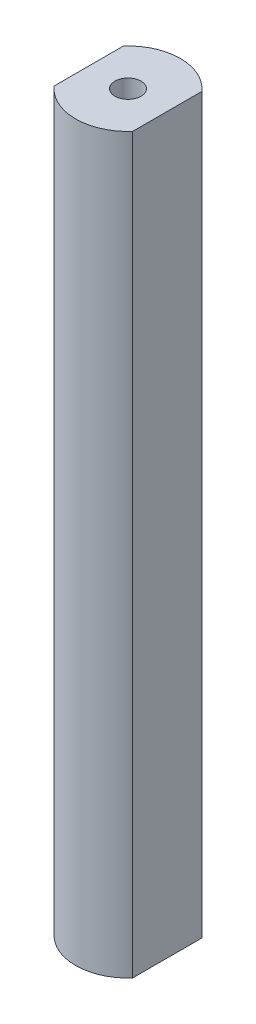
ISO-10303-21;
HEADER;
FILE_DESCRIPTION(('STEP AP214'),'2;1');
FILE_NAME('part.step','',(''),(''),'','','');
FILE_SCHEMA(('AUTOMOTIVE_DESIGN { 1 0 10303 214 1 1 1 1 }'));
ENDSEC;
DATA;
#1=APPLICATION_CONTEXT('core data for automotive mechanical design processes');
#2=APPLICATION_PROTOCOL_DEFINITION('international standard','automotive_design',2000,#1);
#3=PRODUCT_CONTEXT('',#1,'mechanical');
#4=PRODUCT('Part','Part','',(#3));
#5=PRODUCT_RELATED_PRODUCT_CATEGORY('part','',(#4));
#6=PRODUCT_DEFINITION_FORMATION('','',#4);
#7=PRODUCT_DEFINITION_CONTEXT('part definition',#1,'design');
#8=PRODUCT_DEFINITION('design','',#6,#7);
#9=PRODUCT_DEFINITION_SHAPE('','',#8);
#10=(LENGTH_UNIT() NAMED_UNIT(*) SI_UNIT(.MILLI.,.METRE.));
#11=(NAMED_UNIT(*) PLANE_ANGLE_UNIT() SI_UNIT($,.RADIAN.));
#12=(NAMED_UNIT(*) SI_UNIT($,.STERADIAN.) SOLID_ANGLE_UNIT());
#13=UNCERTAINTY_MEASURE_WITH_UNIT(LENGTH_MEASURE(1.E-05),#10,'distance_accuracy_value','');
#14=(GEOMETRIC_REPRESENTATION_CONTEXT(3) GLOBAL_UNCERTAINTY_ASSIGNED_CONTEXT((#13)) GLOBAL_UNIT_ASSIGNED_CONTEXT((#10,
#11,#12)) REPRESENTATION_CONTEXT('',''));
#15=CARTESIAN_POINT('',(0.,0.,0.));
#16=DIRECTION('',(0.,0.,1.));
#17=DIRECTION('',(1.,0.,0.));
#18=AXIS2_PLACEMENT_3D('',#15,#16,#17);
#19=CARTESIAN_POINT('',(0.,88.9,0.));
#20=DIRECTION('',(0.,1.,0.));
#21=DIRECTION('',(0.,0.,1.));
#22=AXIS2_PLACEMENT_3D('',#19,#20,#21);
#23=PLANE('',#22);
#24=DIRECTION('',(0.,0.,-1.));
#25=VECTOR('',#24,1.);
#26=CARTESIAN_POINT('',(-4.7625,88.9,0.));
#27=LINE('',#26,#25);
#28=CARTESIAN_POINT('',(-4.7625,88.9,4.20013020631504));
#29=VERTEX_POINT('',#28);
#30=CARTESIAN_POINT('',(-4.7625,88.9,-4.20013020631504));
#31=VERTEX_POINT('',#30);
#32=EDGE_CURVE('E63',#29,#31,#27,.T.);
#33=ORIENTED_EDGE('',*,*,#32,.F.);
#34=CARTESIAN_POINT('',(0.,88.9,0.));
#35=DIRECTION('',(0.,1.,0.));
#36=DIRECTION('',(0.,0.,1.));
#37=AXIS2_PLACEMENT_3D('',#34,#35,#36);
#38=CIRCLE('',#37,6.35);
#39=CARTESIAN_POINT('',(4.7625,88.9,4.20013020631504));
#40=VERTEX_POINT('',#39);
#41=EDGE_CURVE('E48',#29,#40,#38,.T.);
#42=ORIENTED_EDGE('',*,*,#41,.T.);
#43=DIRECTION('',(0.,0.,-1.));
#44=VECTOR('',#43,1.);
#45=CARTESIAN_POINT('',(4.7625,88.9,0.));
#46=LINE('',#45,#44);
#47=CARTESIAN_POINT('',(4.7625,88.9,-4.20013020631504));
#48=VERTEX_POINT('',#47);
#49=EDGE_CURVE('E118',#40,#48,#46,.T.);
#50=ORIENTED_EDGE('',*,*,#49,.T.);
#51=EDGE_CURVE('E11',#48,#31,#38,.T.);
#52=ORIENTED_EDGE('',*,*,#51,.T.);
#53=EDGE_LOOP('',(#33,#42,#50,#52));
#54=FACE_BOUND('',#53,.T.);
#55=CARTESIAN_POINT('',(0.,88.9,0.));
#56=DIRECTION('',(0.,1.,0.));
#57=DIRECTION('',(0.,0.,1.));
#58=AXIS2_PLACEMENT_3D('',#55,#56,#57);
#59=CIRCLE('',#58,1.5875);
#60=CARTESIAN_POINT('',(0.,88.9,1.5875));
#61=VERTEX_POINT('',#60);
#62=EDGE_CURVE('E100',#61,#61,#59,.T.);
#63=ORIENTED_EDGE('',*,*,#62,.F.);
#64=EDGE_LOOP('',(#63));
#65=FACE_BOUND('',#64,.T.);
#66=ADVANCED_FACE('F38',(#54,#65),#23,.T.);
#67=CARTESIAN_POINT('',(0.,0.,0.));
#68=DIRECTION('',(0.,1.,0.));
#69=DIRECTION('',(0.,0.,1.));
#70=AXIS2_PLACEMENT_3D('',#67,#68,#69);
#71=PLANE('',#70);
#72=CARTESIAN_POINT('',(0.,0.,0.));
#73=DIRECTION('',(0.,1.,0.));
#74=DIRECTION('',(0.,0.,1.));
#75=AXIS2_PLACEMENT_3D('',#72,#73,#74);
#76=CIRCLE('',#75,1.5875);
#77=CARTESIAN_POINT('',(0.,0.,1.5875));
#78=VERTEX_POINT('',#77);
#79=EDGE_CURVE('E104',#78,#78,#76,.T.);
#80=ORIENTED_EDGE('',*,*,#79,.T.);
#81=EDGE_LOOP('',(#80));
#82=FACE_BOUND('',#81,.T.);
#83=CARTESIAN_POINT('',(0.,0.,0.));
#84=DIRECTION('',(0.,1.,0.));
#85=DIRECTION('',(0.,0.,1.));
#86=AXIS2_PLACEMENT_3D('',#83,#84,#85);
#87=CIRCLE('',#86,6.35);
#88=CARTESIAN_POINT('',(-4.7625,0.,4.20013020631504));
#89=VERTEX_POINT('',#88);
#90=CARTESIAN_POINT('',(4.7625,0.,4.20013020631504));
#91=VERTEX_POINT('',#90);
#92=EDGE_CURVE('E42',#89,#91,#87,.T.);
#93=ORIENTED_EDGE('',*,*,#92,.F.);
#94=DIRECTION('',(0.,0.,-1.));
#95=VECTOR('',#94,1.);
#96=CARTESIAN_POINT('',(-4.7625,0.,0.));
#97=LINE('',#96,#95);
#98=CARTESIAN_POINT('',(-4.7625,0.,-4.20013020631504));
#99=VERTEX_POINT('',#98);
#100=EDGE_CURVE('E79',#89,#99,#97,.T.);
#101=ORIENTED_EDGE('',*,*,#100,.T.);
#102=CARTESIAN_POINT('',(4.7625,0.,-4.20013020631504));
#103=VERTEX_POINT('',#102);
#104=EDGE_CURVE('E99',#103,#99,#87,.T.);
#105=ORIENTED_EDGE('',*,*,#104,.F.);
#106=DIRECTION('',(0.,0.,-1.));
#107=VECTOR('',#106,1.);
#108=CARTESIAN_POINT('',(4.7625,0.,0.));
#109=LINE('',#108,#107);
#110=EDGE_CURVE('E55',#91,#103,#109,.T.);
#111=ORIENTED_EDGE('',*,*,#110,.F.);
#112=EDGE_LOOP('',(#93,#101,#105,#111));
#113=FACE_BOUND('',#112,.T.);
#114=ADVANCED_FACE('F97',(#82,#113),#71,.F.);
#115=CARTESIAN_POINT('',(0.,88.9,0.));
#116=DIRECTION('',(0.,-1.,0.));
#117=DIRECTION('',(0.,0.,-1.));
#118=AXIS2_PLACEMENT_3D('',#115,#116,#117);
#119=CYLINDRICAL_SURFACE('',#118,6.35);
#120=ORIENTED_EDGE('',*,*,#41,.F.);
#121=DIRECTION('',(0.,1.,0.));
#122=VECTOR('',#121,1.);
#123=CARTESIAN_POINT('',(-4.7625,0.,4.20013020631504));
#124=LINE('',#123,#122);
#125=EDGE_CURVE('E82',#89,#29,#124,.T.);
#126=ORIENTED_EDGE('',*,*,#125,.F.);
#127=ORIENTED_EDGE('',*,*,#92,.T.);
#128=DIRECTION('',(0.,1.,0.));
#129=VECTOR('',#128,1.);
#130=CARTESIAN_POINT('',(4.7625,0.,4.20013020631504));
#131=LINE('',#130,#129);
#132=EDGE_CURVE('E112',#91,#40,#131,.T.);
#133=ORIENTED_EDGE('',*,*,#132,.T.);
#134=EDGE_LOOP('',(#120,#126,#127,#133));
#135=FACE_BOUND('',#134,.T.);
#136=ADVANCED_FACE('F40',(#135),#119,.T.);
#137=ORIENTED_EDGE('',*,*,#104,.T.);
#138=DIRECTION('',(0.,1.,0.));
#139=VECTOR('',#138,1.);
#140=CARTESIAN_POINT('',(-4.7625,0.,-4.20013020631504));
#141=LINE('',#140,#139);
#142=EDGE_CURVE('E83',#99,#31,#141,.T.);
#143=ORIENTED_EDGE('',*,*,#142,.T.);
#144=ORIENTED_EDGE('',*,*,#51,.F.);
#145=DIRECTION('',(0.,1.,0.));
#146=VECTOR('',#145,1.);
#147=CARTESIAN_POINT('',(4.7625,0.,-4.20013020631504));
#148=LINE('',#147,#146);
#149=EDGE_CURVE('E121',#103,#48,#148,.T.);
#150=ORIENTED_EDGE('',*,*,#149,.F.);
#151=EDGE_LOOP('',(#137,#143,#144,#150));
#152=FACE_BOUND('',#151,.T.);
#153=ADVANCED_FACE('F133',(#152),#119,.T.);
#154=CARTESIAN_POINT('',(0.,88.9,0.));
#155=DIRECTION('',(0.,-1.,0.));
#156=DIRECTION('',(0.,0.,-1.));
#157=AXIS2_PLACEMENT_3D('',#154,#155,#156);
#158=CYLINDRICAL_SURFACE('',#157,1.5875);
#159=ORIENTED_EDGE('',*,*,#62,.T.);
#160=EDGE_LOOP('',(#159));
#161=FACE_BOUND('',#160,.T.);
#162=ORIENTED_EDGE('',*,*,#79,.F.);
#163=EDGE_LOOP('',(#162));
#164=FACE_BOUND('',#163,.T.);
#165=ADVANCED_FACE('F135',(#161,#164),#158,.F.);
#166=CARTESIAN_POINT('',(4.7625,0.,0.));
#167=DIRECTION('',(1.,0.,0.));
#168=DIRECTION('',(0.,0.,-1.));
#169=AXIS2_PLACEMENT_3D('',#166,#167,#168);
#170=PLANE('',#169);
#171=ORIENTED_EDGE('',*,*,#49,.F.);
#172=ORIENTED_EDGE('',*,*,#132,.F.);
#173=ORIENTED_EDGE('',*,*,#110,.T.);
#174=ORIENTED_EDGE('',*,*,#149,.T.);
#175=EDGE_LOOP('',(#171,#172,#173,#174));
#176=FACE_BOUND('',#175,.T.);
#177=ADVANCED_FACE('F131',(#176),#170,.T.);
#178=CARTESIAN_POINT('',(-4.7625,0.,0.));
#179=DIRECTION('',(1.,0.,0.));
#180=DIRECTION('',(0.,0.,-1.));
#181=AXIS2_PLACEMENT_3D('',#178,#179,#180);
#182=PLANE('',#181);
#183=ORIENTED_EDGE('',*,*,#32,.T.);
#184=ORIENTED_EDGE('',*,*,#142,.F.);
#185=ORIENTED_EDGE('',*,*,#100,.F.);
#186=ORIENTED_EDGE('',*,*,#125,.T.);
#187=EDGE_LOOP('',(#183,#184,#185,#186));
#188=FACE_BOUND('',#187,.T.);
#189=ADVANCED_FACE('F81',(#188),#182,.F.);
#190=CLOSED_SHELL('',(#66,#114,#136,#153,#165,#177,#189));
#191=MANIFOLD_SOLID_BREP('B2',#190);
#192=ADVANCED_BREP_SHAPE_REPRESENTATION('',(#18,#191),#14);
#193=SHAPE_DEFINITION_REPRESENTATION(#9,#192);
ENDSEC;
END-ISO-10303-21;
